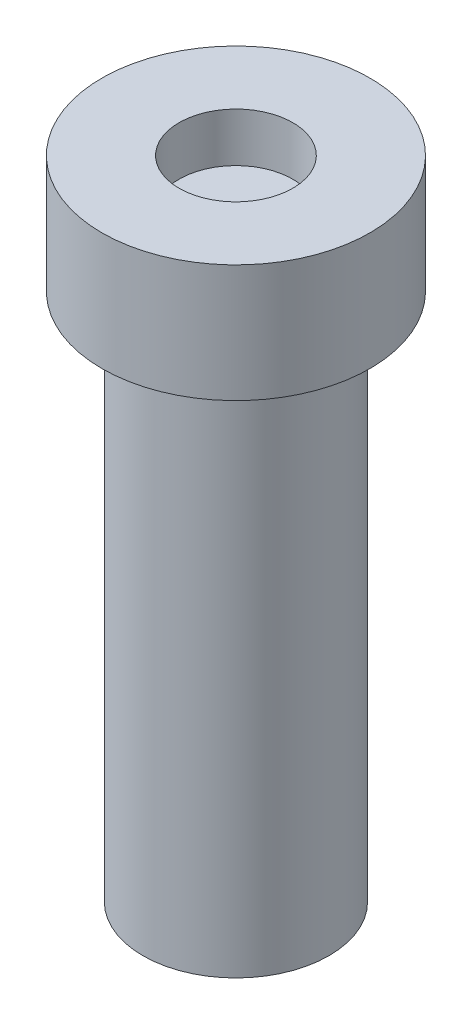
ISO-10303-21;
HEADER;
FILE_DESCRIPTION(('STEP AP214'),'2;1');
FILE_NAME('part.step','',(''),(''),'','','');
FILE_SCHEMA(('AUTOMOTIVE_DESIGN { 1 0 10303 214 1 1 1 1 }'));
ENDSEC;
DATA;
#1=APPLICATION_CONTEXT('core data for automotive mechanical design processes');
#2=APPLICATION_PROTOCOL_DEFINITION('international standard','automotive_design',2000,#1);
#3=PRODUCT_CONTEXT('',#1,'mechanical');
#4=PRODUCT('Part','Part','',(#3));
#5=PRODUCT_RELATED_PRODUCT_CATEGORY('part','',(#4));
#6=PRODUCT_DEFINITION_FORMATION('','',#4);
#7=PRODUCT_DEFINITION_CONTEXT('part definition',#1,'design');
#8=PRODUCT_DEFINITION('design','',#6,#7);
#9=PRODUCT_DEFINITION_SHAPE('','',#8);
#10=(LENGTH_UNIT() NAMED_UNIT(*) SI_UNIT(.MILLI.,.METRE.));
#11=(NAMED_UNIT(*) PLANE_ANGLE_UNIT() SI_UNIT($,.RADIAN.));
#12=(NAMED_UNIT(*) SI_UNIT($,.STERADIAN.) SOLID_ANGLE_UNIT());
#13=UNCERTAINTY_MEASURE_WITH_UNIT(LENGTH_MEASURE(1.E-05),#10,'distance_accuracy_value','');
#14=(GEOMETRIC_REPRESENTATION_CONTEXT(3) GLOBAL_UNCERTAINTY_ASSIGNED_CONTEXT((#13)) GLOBAL_UNIT_ASSIGNED_CONTEXT((#10,
#11,#12)) REPRESENTATION_CONTEXT('',''));
#15=CARTESIAN_POINT('',(0.,0.,0.));
#16=DIRECTION('',(0.,0.,1.));
#17=DIRECTION('',(1.,0.,0.));
#18=AXIS2_PLACEMENT_3D('',#15,#16,#17);
#19=CARTESIAN_POINT('',(6.842054746829,25.0602093738261,0.));
#20=DIRECTION('',(0.,1.,0.));
#21=DIRECTION('',(0.,0.,1.));
#22=AXIS2_PLACEMENT_3D('',#19,#20,#21);
#23=PLANE('',#22);
#24=CARTESIAN_POINT('',(0.,25.0602093738261,0.));
#25=DIRECTION('',(0.,1.,0.));
#26=DIRECTION('',(0.,0.,1.));
#27=AXIS2_PLACEMENT_3D('',#24,#25,#26);
#28=CIRCLE('',#27,6.842054746829);
#29=CARTESIAN_POINT('',(0.,25.0602093738261,6.842054746829));
#30=VERTEX_POINT('',#29);
#31=EDGE_CURVE('E10',#30,#30,#28,.T.);
#32=ORIENTED_EDGE('',*,*,#31,.F.);
#33=EDGE_LOOP('',(#32));
#34=FACE_BOUND('',#33,.T.);
#35=CARTESIAN_POINT('',(0.,25.0602093738261,0.));
#36=DIRECTION('',(0.,1.,0.));
#37=DIRECTION('',(0.,0.,1.));
#38=AXIS2_PLACEMENT_3D('',#35,#36,#37);
#39=CIRCLE('',#38,4.75);
#40=CARTESIAN_POINT('',(0.,25.0602093738261,4.75));
#41=VERTEX_POINT('',#40);
#42=EDGE_CURVE('E57',#41,#41,#39,.T.);
#43=ORIENTED_EDGE('',*,*,#42,.T.);
#44=EDGE_LOOP('',(#43));
#45=FACE_BOUND('',#44,.T.);
#46=ADVANCED_FACE('F35',(#34,#45),#23,.F.);
#47=CARTESIAN_POINT('',(0.,0.,0.));
#48=DIRECTION('',(0.,1.,0.));
#49=DIRECTION('',(0.,0.,1.));
#50=AXIS2_PLACEMENT_3D('',#47,#48,#49);
#51=CYLINDRICAL_SURFACE('',#50,6.842054746829);
#52=CARTESIAN_POINT('',(0.,31.0602093738261,0.));
#53=DIRECTION('',(0.,1.,0.));
#54=DIRECTION('',(0.,0.,1.));
#55=AXIS2_PLACEMENT_3D('',#52,#53,#54);
#56=CIRCLE('',#55,6.842054746829);
#57=CARTESIAN_POINT('',(0.,31.0602093738261,6.842054746829));
#58=VERTEX_POINT('',#57);
#59=EDGE_CURVE('E41',#58,#58,#56,.T.);
#60=ORIENTED_EDGE('',*,*,#59,.F.);
#61=EDGE_LOOP('',(#60));
#62=FACE_BOUND('',#61,.T.);
#63=ORIENTED_EDGE('',*,*,#31,.T.);
#64=EDGE_LOOP('',(#63));
#65=FACE_BOUND('',#64,.T.);
#66=ADVANCED_FACE('F79',(#62,#65),#51,.T.);
#67=CARTESIAN_POINT('',(2.90235912394132,31.0602093738261,0.));
#68=DIRECTION('',(0.,-1.,0.));
#69=DIRECTION('',(0.,0.,-1.));
#70=AXIS2_PLACEMENT_3D('',#67,#68,#69);
#71=PLANE('',#70);
#72=CARTESIAN_POINT('',(0.,31.0602093738261,0.));
#73=DIRECTION('',(0.,1.,0.));
#74=DIRECTION('',(0.,0.,1.));
#75=AXIS2_PLACEMENT_3D('',#72,#73,#74);
#76=CIRCLE('',#75,2.90235912394132);
#77=CARTESIAN_POINT('',(0.,31.0602093738261,2.90235912394132));
#78=VERTEX_POINT('',#77);
#79=EDGE_CURVE('E45',#78,#78,#76,.T.);
#80=ORIENTED_EDGE('',*,*,#79,.F.);
#81=EDGE_LOOP('',(#80));
#82=FACE_BOUND('',#81,.T.);
#83=ORIENTED_EDGE('',*,*,#59,.T.);
#84=EDGE_LOOP('',(#83));
#85=FACE_BOUND('',#84,.T.);
#86=ADVANCED_FACE('F84',(#82,#85),#71,.F.);
#87=CARTESIAN_POINT('',(0.,0.,0.));
#88=DIRECTION('',(0.,1.,0.));
#89=DIRECTION('',(0.,0.,1.));
#90=AXIS2_PLACEMENT_3D('',#87,#88,#89);
#91=CYLINDRICAL_SURFACE('',#90,2.90235912394132);
#92=CARTESIAN_POINT('',(0.,28.5602093738261,0.));
#93=DIRECTION('',(0.,1.,0.));
#94=DIRECTION('',(0.,0.,1.));
#95=AXIS2_PLACEMENT_3D('',#92,#93,#94);
#96=CIRCLE('',#95,2.90235912394132);
#97=CARTESIAN_POINT('',(0.,28.5602093738261,2.90235912394132));
#98=VERTEX_POINT('',#97);
#99=EDGE_CURVE('E49',#98,#98,#96,.T.);
#100=ORIENTED_EDGE('',*,*,#99,.F.);
#101=EDGE_LOOP('',(#100));
#102=FACE_BOUND('',#101,.T.);
#103=ORIENTED_EDGE('',*,*,#79,.T.);
#104=EDGE_LOOP('',(#103));
#105=FACE_BOUND('',#104,.T.);
#106=ADVANCED_FACE('F75',(#102,#105),#91,.F.);
#107=CARTESIAN_POINT('',(2.90235912394132,28.5602093738261,0.));
#108=DIRECTION('',(0.,-1.,0.));
#109=DIRECTION('',(0.,0.,-1.));
#110=AXIS2_PLACEMENT_3D('',#107,#108,#109);
#111=PLANE('',#110);
#112=ORIENTED_EDGE('',*,*,#99,.T.);
#113=EDGE_LOOP('',(#112));
#114=FACE_BOUND('',#113,.T.);
#115=ADVANCED_FACE('F70',(#114),#111,.F.);
#116=CARTESIAN_POINT('',(4.75,-1.93979062617391,0.));
#117=DIRECTION('',(0.,1.,0.));
#118=DIRECTION('',(0.,0.,1.));
#119=AXIS2_PLACEMENT_3D('',#116,#117,#118);
#120=PLANE('',#119);
#121=CARTESIAN_POINT('',(0.,-1.93979062617391,0.));
#122=DIRECTION('',(0.,1.,0.));
#123=DIRECTION('',(0.,0.,1.));
#124=AXIS2_PLACEMENT_3D('',#121,#122,#123);
#125=CIRCLE('',#124,4.75);
#126=CARTESIAN_POINT('',(0.,-1.93979062617391,4.75));
#127=VERTEX_POINT('',#126);
#128=EDGE_CURVE('E54',#127,#127,#125,.T.);
#129=ORIENTED_EDGE('',*,*,#128,.F.);
#130=EDGE_LOOP('',(#129));
#131=FACE_BOUND('',#130,.T.);
#132=ADVANCED_FACE('F65',(#131),#120,.F.);
#133=CARTESIAN_POINT('',(0.,0.,0.));
#134=DIRECTION('',(0.,1.,0.));
#135=DIRECTION('',(0.,0.,1.));
#136=AXIS2_PLACEMENT_3D('',#133,#134,#135);
#137=CYLINDRICAL_SURFACE('',#136,4.75);
#138=ORIENTED_EDGE('',*,*,#42,.F.);
#139=EDGE_LOOP('',(#138));
#140=FACE_BOUND('',#139,.T.);
#141=ORIENTED_EDGE('',*,*,#128,.T.);
#142=EDGE_LOOP('',(#141));
#143=FACE_BOUND('',#142,.T.);
#144=ADVANCED_FACE('F62',(#140,#143),#137,.T.);
#145=CLOSED_SHELL('',(#46,#66,#86,#106,#115,#132,#144));
#146=MANIFOLD_SOLID_BREP('B2',#145);
#147=ADVANCED_BREP_SHAPE_REPRESENTATION('',(#18,#146),#14);
#148=SHAPE_DEFINITION_REPRESENTATION(#9,#147);
ENDSEC;
END-ISO-10303-21;
